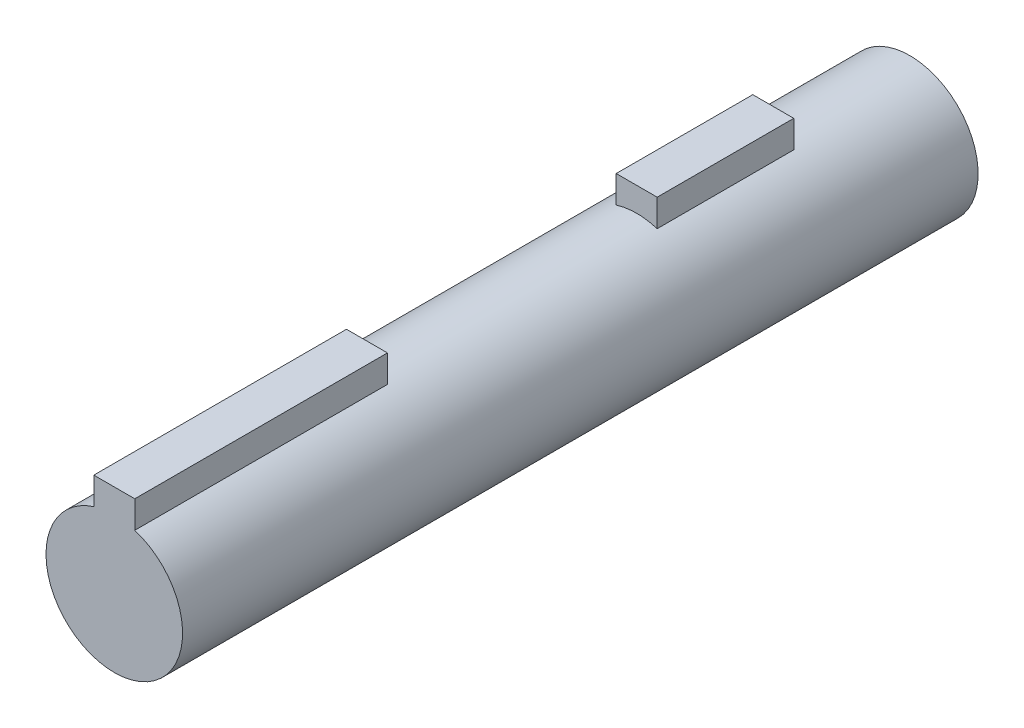
ISO-10303-21;
HEADER;
FILE_DESCRIPTION(('STEP AP214'),'2;1');
FILE_NAME('part.step','',(''),(''),'','','');
FILE_SCHEMA(('AUTOMOTIVE_DESIGN { 1 0 10303 214 1 1 1 1 }'));
ENDSEC;
DATA;
#1=APPLICATION_CONTEXT('core data for automotive mechanical design processes');
#2=APPLICATION_PROTOCOL_DEFINITION('international standard','automotive_design',2000,#1);
#3=PRODUCT_CONTEXT('',#1,'mechanical');
#4=PRODUCT('Part','Part','',(#3));
#5=PRODUCT_RELATED_PRODUCT_CATEGORY('part','',(#4));
#6=PRODUCT_DEFINITION_FORMATION('','',#4);
#7=PRODUCT_DEFINITION_CONTEXT('part definition',#1,'design');
#8=PRODUCT_DEFINITION('design','',#6,#7);
#9=PRODUCT_DEFINITION_SHAPE('','',#8);
#10=(LENGTH_UNIT() NAMED_UNIT(*) SI_UNIT(.MILLI.,.METRE.));
#11=(NAMED_UNIT(*) PLANE_ANGLE_UNIT() SI_UNIT($,.RADIAN.));
#12=(NAMED_UNIT(*) SI_UNIT($,.STERADIAN.) SOLID_ANGLE_UNIT());
#13=UNCERTAINTY_MEASURE_WITH_UNIT(LENGTH_MEASURE(1.E-05),#10,'distance_accuracy_value','');
#14=(GEOMETRIC_REPRESENTATION_CONTEXT(3) GLOBAL_UNCERTAINTY_ASSIGNED_CONTEXT((#13)) GLOBAL_UNIT_ASSIGNED_CONTEXT((#10,
#11,#12)) REPRESENTATION_CONTEXT('',''));
#15=CARTESIAN_POINT('',(0.,0.,0.));
#16=DIRECTION('',(0.,0.,1.));
#17=DIRECTION('',(1.,0.,0.));
#18=AXIS2_PLACEMENT_3D('',#15,#16,#17);
#19=CARTESIAN_POINT('',(0.,0.,20.));
#20=DIRECTION('',(0.,0.,-1.));
#21=DIRECTION('',(-1.,0.,0.));
#22=AXIS2_PLACEMENT_3D('',#19,#20,#21);
#23=CYLINDRICAL_SURFACE('',#22,5.);
#24=CARTESIAN_POINT('',(0.,0.,22.));
#25=DIRECTION('',(0.,0.,-1.));
#26=DIRECTION('',(-1.,0.,0.));
#27=AXIS2_PLACEMENT_3D('',#24,#25,#26);
#28=CIRCLE('',#27,5.);
#29=CARTESIAN_POINT('',(-5.,0.,22.));
#30=VERTEX_POINT('',#29);
#31=EDGE_CURVE('E141',#30,#30,#28,.T.);
#32=ORIENTED_EDGE('',*,*,#31,.F.);
#33=EDGE_LOOP('',(#32));
#34=FACE_BOUND('',#33,.T.);
#35=CARTESIAN_POINT('',(0.,0.,42.));
#36=DIRECTION('',(0.,0.,-1.));
#37=DIRECTION('',(-1.,0.,0.));
#38=AXIS2_PLACEMENT_3D('',#35,#36,#37);
#39=CIRCLE('',#38,5.);
#40=CARTESIAN_POINT('',(-1.5,4.76969600708473,42.));
#41=VERTEX_POINT('',#40);
#42=CARTESIAN_POINT('',(1.5,4.76969600708473,42.));
#43=VERTEX_POINT('',#42);
#44=EDGE_CURVE('E171',#41,#43,#39,.T.);
#45=ORIENTED_EDGE('',*,*,#44,.F.);
#46=DIRECTION('',(0.,0.,1.));
#47=VECTOR('',#46,1.);
#48=CARTESIAN_POINT('',(-1.5,4.76969600708473,32.));
#49=LINE('',#48,#47);
#50=CARTESIAN_POINT('',(-1.5,4.76969600708473,32.));
#51=VERTEX_POINT('',#50);
#52=EDGE_CURVE('E165',#51,#41,#49,.T.);
#53=ORIENTED_EDGE('',*,*,#52,.F.);
#54=CARTESIAN_POINT('',(0.,0.,32.));
#55=DIRECTION('',(0.,0.,-1.));
#56=DIRECTION('',(-1.,0.,0.));
#57=AXIS2_PLACEMENT_3D('',#54,#55,#56);
#58=CIRCLE('',#57,5.);
#59=CARTESIAN_POINT('',(1.5,4.76969600708473,32.));
#60=VERTEX_POINT('',#59);
#61=EDGE_CURVE('E140',#51,#60,#58,.T.);
#62=ORIENTED_EDGE('',*,*,#61,.T.);
#63=DIRECTION('',(0.,0.,1.));
#64=VECTOR('',#63,1.);
#65=CARTESIAN_POINT('',(1.5,4.76969600708473,32.));
#66=LINE('',#65,#64);
#67=EDGE_CURVE('E168',#60,#43,#66,.T.);
#68=ORIENTED_EDGE('',*,*,#67,.T.);
#69=EDGE_LOOP('',(#45,#53,#62,#68));
#70=FACE_BOUND('',#69,.T.);
#71=DIRECTION('',(0.,0.,-1.));
#72=VECTOR('',#71,1.);
#73=CARTESIAN_POINT('',(-1.5,4.76969600708473,76.));
#74=LINE('',#73,#72);
#75=CARTESIAN_POINT('',(-1.5,4.76969600708473,80.25));
#76=VERTEX_POINT('',#75);
#77=CARTESIAN_POINT('',(-1.5,4.76969600708473,61.75));
#78=VERTEX_POINT('',#77);
#79=EDGE_CURVE('E63',#76,#78,#74,.T.);
#80=ORIENTED_EDGE('',*,*,#79,.T.);
#81=CARTESIAN_POINT('',(0.,0.,61.75));
#82=DIRECTION('',(0.,0.,1.));
#83=DIRECTION('',(-1.,0.,0.));
#84=AXIS2_PLACEMENT_3D('',#81,#82,#83);
#85=CIRCLE('',#84,5.);
#86=CARTESIAN_POINT('',(1.5,4.76969600708473,61.75));
#87=VERTEX_POINT('',#86);
#88=EDGE_CURVE('E123',#87,#78,#85,.T.);
#89=ORIENTED_EDGE('',*,*,#88,.F.);
#90=DIRECTION('',(0.,0.,-1.));
#91=VECTOR('',#90,1.);
#92=CARTESIAN_POINT('',(1.5,4.76969600708473,76.));
#93=LINE('',#92,#91);
#94=CARTESIAN_POINT('',(1.5,4.76969600708473,80.25));
#95=VERTEX_POINT('',#94);
#96=EDGE_CURVE('E11',#95,#87,#93,.T.);
#97=ORIENTED_EDGE('',*,*,#96,.F.);
#98=CARTESIAN_POINT('',(0.,0.,80.25));
#99=DIRECTION('',(0.,0.,1.));
#100=DIRECTION('',(1.,0.,0.));
#101=AXIS2_PLACEMENT_3D('',#98,#99,#100);
#102=CIRCLE('',#101,5.);
#103=EDGE_CURVE('E128',#76,#95,#102,.T.);
#104=ORIENTED_EDGE('',*,*,#103,.F.);
#105=EDGE_LOOP('',(#80,#89,#97,#104));
#106=FACE_BOUND('',#105,.T.);
#107=ADVANCED_FACE('F44',(#34,#70,#106),#23,.T.);
#108=CARTESIAN_POINT('',(1.5,6.76969600708473,76.));
#109=DIRECTION('',(-1.,0.,0.));
#110=DIRECTION('',(0.,-1.,0.));
#111=AXIS2_PLACEMENT_3D('',#108,#109,#110);
#112=PLANE('',#111);
#113=ORIENTED_EDGE('',*,*,#96,.T.);
#114=DIRECTION('',(0.,-1.,0.));
#115=VECTOR('',#114,1.);
#116=CARTESIAN_POINT('',(1.5,6.76969600708473,61.75));
#117=LINE('',#116,#115);
#118=CARTESIAN_POINT('',(1.5,6.76969600708473,61.75));
#119=VERTEX_POINT('',#118);
#120=EDGE_CURVE('E126',#119,#87,#117,.T.);
#121=ORIENTED_EDGE('',*,*,#120,.F.);
#122=DIRECTION('',(0.,0.,-1.));
#123=VECTOR('',#122,1.);
#124=CARTESIAN_POINT('',(1.5,6.76969600708473,76.));
#125=LINE('',#124,#123);
#126=CARTESIAN_POINT('',(1.5,6.76969600708473,80.25));
#127=VERTEX_POINT('',#126);
#128=EDGE_CURVE('E51',#127,#119,#125,.T.);
#129=ORIENTED_EDGE('',*,*,#128,.F.);
#130=DIRECTION('',(0.,1.,0.));
#131=VECTOR('',#130,1.);
#132=CARTESIAN_POINT('',(1.5,4.76969600708473,80.25));
#133=LINE('',#132,#131);
#134=EDGE_CURVE('E134',#95,#127,#133,.T.);
#135=ORIENTED_EDGE('',*,*,#134,.F.);
#136=EDGE_LOOP('',(#113,#121,#129,#135));
#137=FACE_BOUND('',#136,.T.);
#138=ADVANCED_FACE('F207',(#137),#112,.F.);
#139=CARTESIAN_POINT('',(-1.5,6.76969600708473,76.));
#140=DIRECTION('',(0.,-1.,0.));
#141=DIRECTION('',(0.,0.,-1.));
#142=AXIS2_PLACEMENT_3D('',#139,#140,#141);
#143=PLANE('',#142);
#144=ORIENTED_EDGE('',*,*,#128,.T.);
#145=DIRECTION('',(1.,0.,0.));
#146=VECTOR('',#145,1.);
#147=CARTESIAN_POINT('',(-1.5,6.76969600708473,61.75));
#148=LINE('',#147,#146);
#149=CARTESIAN_POINT('',(-1.5,6.76969600708473,61.75));
#150=VERTEX_POINT('',#149);
#151=EDGE_CURVE('E122',#150,#119,#148,.T.);
#152=ORIENTED_EDGE('',*,*,#151,.F.);
#153=DIRECTION('',(0.,0.,-1.));
#154=VECTOR('',#153,1.);
#155=CARTESIAN_POINT('',(-1.5,6.76969600708473,76.));
#156=LINE('',#155,#154);
#157=CARTESIAN_POINT('',(-1.5,6.76969600708473,80.25));
#158=VERTEX_POINT('',#157);
#159=EDGE_CURVE('E106',#158,#150,#156,.T.);
#160=ORIENTED_EDGE('',*,*,#159,.F.);
#161=DIRECTION('',(-1.,0.,0.));
#162=VECTOR('',#161,1.);
#163=CARTESIAN_POINT('',(1.5,6.76969600708473,80.25));
#164=LINE('',#163,#162);
#165=EDGE_CURVE('E137',#127,#158,#164,.T.);
#166=ORIENTED_EDGE('',*,*,#165,.F.);
#167=EDGE_LOOP('',(#144,#152,#160,#166));
#168=FACE_BOUND('',#167,.T.);
#169=ADVANCED_FACE('F125',(#168),#143,.F.);
#170=CARTESIAN_POINT('',(-1.5,4.76969600708473,76.));
#171=DIRECTION('',(1.,0.,0.));
#172=DIRECTION('',(0.,1.,0.));
#173=AXIS2_PLACEMENT_3D('',#170,#171,#172);
#174=PLANE('',#173);
#175=ORIENTED_EDGE('',*,*,#159,.T.);
#176=DIRECTION('',(0.,1.,0.));
#177=VECTOR('',#176,1.);
#178=CARTESIAN_POINT('',(-1.5,4.76969600708473,61.75));
#179=LINE('',#178,#177);
#180=EDGE_CURVE('E109',#78,#150,#179,.T.);
#181=ORIENTED_EDGE('',*,*,#180,.F.);
#182=ORIENTED_EDGE('',*,*,#79,.F.);
#183=DIRECTION('',(0.,-1.,0.));
#184=VECTOR('',#183,1.);
#185=CARTESIAN_POINT('',(-1.5,6.76969600708473,80.25));
#186=LINE('',#185,#184);
#187=EDGE_CURVE('E112',#158,#76,#186,.T.);
#188=ORIENTED_EDGE('',*,*,#187,.F.);
#189=EDGE_LOOP('',(#175,#181,#182,#188));
#190=FACE_BOUND('',#189,.T.);
#191=ADVANCED_FACE('F108',(#190),#174,.F.);
#192=CARTESIAN_POINT('',(0.,0.,42.));
#193=DIRECTION('',(0.,0.,-1.));
#194=DIRECTION('',(-1.,0.,0.));
#195=AXIS2_PLACEMENT_3D('',#192,#193,#194);
#196=PLANE('',#195);
#197=DIRECTION('',(0.,1.,0.));
#198=VECTOR('',#197,1.);
#199=CARTESIAN_POINT('',(-1.5,6.76969600708473,42.));
#200=LINE('',#199,#198);
#201=CARTESIAN_POINT('',(-1.5,6.76969600708473,42.));
#202=VERTEX_POINT('',#201);
#203=EDGE_CURVE('E157',#41,#202,#200,.T.);
#204=ORIENTED_EDGE('',*,*,#203,.F.);
#205=ORIENTED_EDGE('',*,*,#44,.T.);
#206=DIRECTION('',(0.,-1.,0.));
#207=VECTOR('',#206,1.);
#208=CARTESIAN_POINT('',(1.5,6.76969600708473,42.));
#209=LINE('',#208,#207);
#210=CARTESIAN_POINT('',(1.5,6.76969600708473,42.));
#211=VERTEX_POINT('',#210);
#212=EDGE_CURVE('E144',#211,#43,#209,.T.);
#213=ORIENTED_EDGE('',*,*,#212,.F.);
#214=DIRECTION('',(1.,0.,0.));
#215=VECTOR('',#214,1.);
#216=CARTESIAN_POINT('',(1.5,6.76969600708473,42.));
#217=LINE('',#216,#215);
#218=EDGE_CURVE('E150',#202,#211,#217,.T.);
#219=ORIENTED_EDGE('',*,*,#218,.F.);
#220=EDGE_LOOP('',(#204,#205,#213,#219));
#221=FACE_BOUND('',#220,.T.);
#222=ADVANCED_FACE('F176',(#221),#196,.F.);
#223=CARTESIAN_POINT('',(1.5,6.76969600708473,32.));
#224=DIRECTION('',(-1.,0.,0.));
#225=DIRECTION('',(0.,0.,1.));
#226=AXIS2_PLACEMENT_3D('',#223,#224,#225);
#227=PLANE('',#226);
#228=ORIENTED_EDGE('',*,*,#212,.T.);
#229=ORIENTED_EDGE('',*,*,#67,.F.);
#230=DIRECTION('',(0.,-1.,0.));
#231=VECTOR('',#230,1.);
#232=CARTESIAN_POINT('',(1.5,6.76969600708473,32.));
#233=LINE('',#232,#231);
#234=CARTESIAN_POINT('',(1.5,6.76969600708473,32.));
#235=VERTEX_POINT('',#234);
#236=EDGE_CURVE('E147',#235,#60,#233,.T.);
#237=ORIENTED_EDGE('',*,*,#236,.F.);
#238=DIRECTION('',(0.,0.,1.));
#239=VECTOR('',#238,1.);
#240=CARTESIAN_POINT('',(1.5,6.76969600708473,32.));
#241=LINE('',#240,#239);
#242=EDGE_CURVE('E154',#235,#211,#241,.T.);
#243=ORIENTED_EDGE('',*,*,#242,.T.);
#244=EDGE_LOOP('',(#228,#229,#237,#243));
#245=FACE_BOUND('',#244,.T.);
#246=ADVANCED_FACE('F184',(#245),#227,.F.);
#247=CARTESIAN_POINT('',(-1.5,6.76969600708473,32.));
#248=DIRECTION('',(1.,0.,0.));
#249=DIRECTION('',(0.,1.,0.));
#250=AXIS2_PLACEMENT_3D('',#247,#248,#249);
#251=PLANE('',#250);
#252=ORIENTED_EDGE('',*,*,#203,.T.);
#253=DIRECTION('',(0.,0.,1.));
#254=VECTOR('',#253,1.);
#255=CARTESIAN_POINT('',(-1.5,6.76969600708473,32.));
#256=LINE('',#255,#254);
#257=CARTESIAN_POINT('',(-1.5,6.76969600708473,32.));
#258=VERTEX_POINT('',#257);
#259=EDGE_CURVE('E162',#258,#202,#256,.T.);
#260=ORIENTED_EDGE('',*,*,#259,.F.);
#261=DIRECTION('',(0.,1.,0.));
#262=VECTOR('',#261,1.);
#263=CARTESIAN_POINT('',(-1.5,6.76969600708473,32.));
#264=LINE('',#263,#262);
#265=EDGE_CURVE('E149',#51,#258,#264,.T.);
#266=ORIENTED_EDGE('',*,*,#265,.F.);
#267=ORIENTED_EDGE('',*,*,#52,.T.);
#268=EDGE_LOOP('',(#252,#260,#266,#267));
#269=FACE_BOUND('',#268,.T.);
#270=ADVANCED_FACE('F191',(#269),#251,.F.);
#271=CARTESIAN_POINT('',(1.5,6.76969600708473,32.));
#272=DIRECTION('',(0.,-1.,0.));
#273=DIRECTION('',(0.,0.,-1.));
#274=AXIS2_PLACEMENT_3D('',#271,#272,#273);
#275=PLANE('',#274);
#276=ORIENTED_EDGE('',*,*,#218,.T.);
#277=ORIENTED_EDGE('',*,*,#242,.F.);
#278=DIRECTION('',(1.,0.,0.));
#279=VECTOR('',#278,1.);
#280=CARTESIAN_POINT('',(1.5,6.76969600708473,32.));
#281=LINE('',#280,#279);
#282=EDGE_CURVE('E152',#258,#235,#281,.T.);
#283=ORIENTED_EDGE('',*,*,#282,.F.);
#284=ORIENTED_EDGE('',*,*,#259,.T.);
#285=EDGE_LOOP('',(#276,#277,#283,#284));
#286=FACE_BOUND('',#285,.T.);
#287=ADVANCED_FACE('F188',(#286),#275,.F.);
#288=CARTESIAN_POINT('',(0.,0.,32.));
#289=DIRECTION('',(0.,0.,-1.));
#290=DIRECTION('',(-1.,0.,0.));
#291=AXIS2_PLACEMENT_3D('',#288,#289,#290);
#292=PLANE('',#291);
#293=ORIENTED_EDGE('',*,*,#61,.F.);
#294=ORIENTED_EDGE('',*,*,#265,.T.);
#295=ORIENTED_EDGE('',*,*,#282,.T.);
#296=ORIENTED_EDGE('',*,*,#236,.T.);
#297=EDGE_LOOP('',(#293,#294,#295,#296));
#298=FACE_BOUND('',#297,.T.);
#299=ADVANCED_FACE('F193',(#298),#292,.T.);
#300=CARTESIAN_POINT('',(0.,0.,22.));
#301=DIRECTION('',(0.,0.,-1.));
#302=DIRECTION('',(-1.,0.,0.));
#303=AXIS2_PLACEMENT_3D('',#300,#301,#302);
#304=PLANE('',#303);
#305=ORIENTED_EDGE('',*,*,#31,.T.);
#306=EDGE_LOOP('',(#305));
#307=FACE_BOUND('',#306,.T.);
#308=ADVANCED_FACE('F195',(#307),#304,.T.);
#309=CARTESIAN_POINT('',(0.,0.,80.25));
#310=DIRECTION('',(0.,0.,1.));
#311=DIRECTION('',(1.,0.,0.));
#312=AXIS2_PLACEMENT_3D('',#309,#310,#311);
#313=PLANE('',#312);
#314=ORIENTED_EDGE('',*,*,#103,.T.);
#315=ORIENTED_EDGE('',*,*,#134,.T.);
#316=ORIENTED_EDGE('',*,*,#165,.T.);
#317=ORIENTED_EDGE('',*,*,#187,.T.);
#318=EDGE_LOOP('',(#314,#315,#316,#317));
#319=FACE_BOUND('',#318,.T.);
#320=ADVANCED_FACE('F201',(#319),#313,.T.);
#321=CARTESIAN_POINT('',(0.,0.,61.75));
#322=DIRECTION('',(0.,0.,-1.));
#323=DIRECTION('',(-1.,0.,0.));
#324=AXIS2_PLACEMENT_3D('',#321,#322,#323);
#325=PLANE('',#324);
#326=ORIENTED_EDGE('',*,*,#88,.T.);
#327=ORIENTED_EDGE('',*,*,#180,.T.);
#328=ORIENTED_EDGE('',*,*,#151,.T.);
#329=ORIENTED_EDGE('',*,*,#120,.T.);
#330=EDGE_LOOP('',(#326,#327,#328,#329));
#331=FACE_BOUND('',#330,.T.);
#332=ADVANCED_FACE('F120',(#331),#325,.T.);
#333=CLOSED_SHELL('',(#107,#138,#169,#191,#222,#246,#270,#287,#299,#308,#320,#332));
#334=MANIFOLD_SOLID_BREP('B2',#333);
#335=ADVANCED_BREP_SHAPE_REPRESENTATION('',(#18,#334),#14);
#336=SHAPE_DEFINITION_REPRESENTATION(#9,#335);
ENDSEC;
END-ISO-10303-21;
